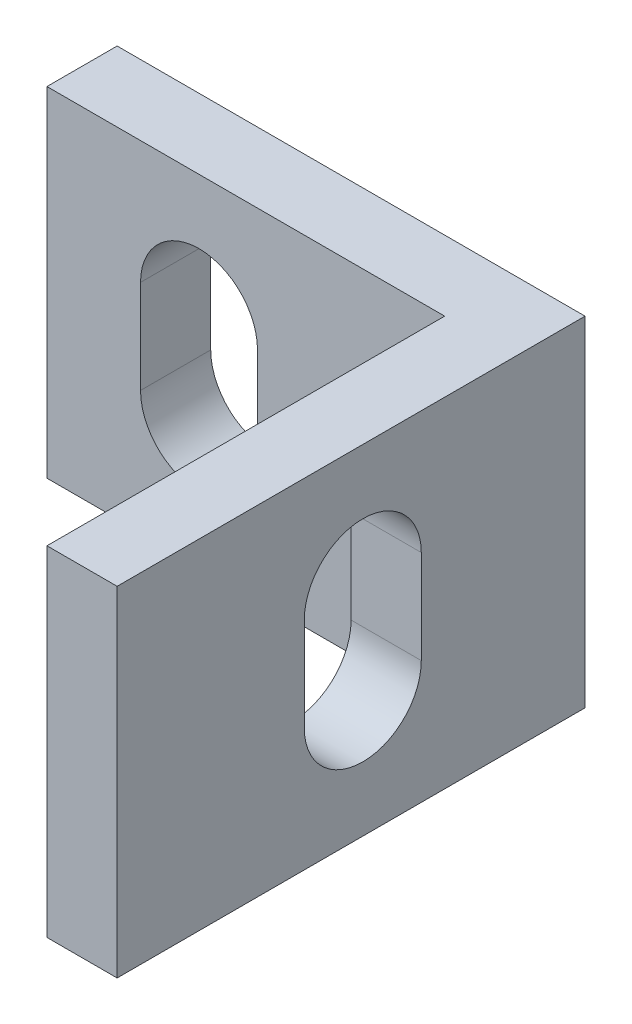
ISO-10303-21;
HEADER;
FILE_DESCRIPTION(('STEP AP214'),'2;1');
FILE_NAME('part.step','',(''),(''),'','','');
FILE_SCHEMA(('AUTOMOTIVE_DESIGN { 1 0 10303 214 1 1 1 1 }'));
ENDSEC;
DATA;
#1=APPLICATION_CONTEXT('core data for automotive mechanical design processes');
#2=APPLICATION_PROTOCOL_DEFINITION('international standard','automotive_design',2000,#1);
#3=PRODUCT_CONTEXT('',#1,'mechanical');
#4=PRODUCT('Part','Part','',(#3));
#5=PRODUCT_RELATED_PRODUCT_CATEGORY('part','',(#4));
#6=PRODUCT_DEFINITION_FORMATION('','',#4);
#7=PRODUCT_DEFINITION_CONTEXT('part definition',#1,'design');
#8=PRODUCT_DEFINITION('design','',#6,#7);
#9=PRODUCT_DEFINITION_SHAPE('','',#8);
#10=(LENGTH_UNIT() NAMED_UNIT(*) SI_UNIT(.MILLI.,.METRE.));
#11=(NAMED_UNIT(*) PLANE_ANGLE_UNIT() SI_UNIT($,.RADIAN.));
#12=(NAMED_UNIT(*) SI_UNIT($,.STERADIAN.) SOLID_ANGLE_UNIT());
#13=UNCERTAINTY_MEASURE_WITH_UNIT(LENGTH_MEASURE(1.E-05),#10,'distance_accuracy_value','');
#14=(GEOMETRIC_REPRESENTATION_CONTEXT(3) GLOBAL_UNCERTAINTY_ASSIGNED_CONTEXT((#13)) GLOBAL_UNIT_ASSIGNED_CONTEXT((#10,
#11,#12)) REPRESENTATION_CONTEXT('',''));
#15=CARTESIAN_POINT('',(0.,0.,0.));
#16=DIRECTION('',(0.,0.,1.));
#17=DIRECTION('',(1.,0.,0.));
#18=AXIS2_PLACEMENT_3D('',#15,#16,#17);
#19=CARTESIAN_POINT('',(-17.,7.25,0.));
#20=DIRECTION('',(0.,0.,-1.));
#21=DIRECTION('',(-1.,0.,0.));
#22=AXIS2_PLACEMENT_3D('',#19,#20,#21);
#23=PLANE('',#22);
#24=DIRECTION('',(0.,1.,0.));
#25=VECTOR('',#24,1.);
#26=CARTESIAN_POINT('',(-13.,7.25,0.));
#27=LINE('',#26,#25);
#28=CARTESIAN_POINT('',(-13.,-2.,0.));
#29=VERTEX_POINT('',#28);
#30=CARTESIAN_POINT('',(-13.,2.,0.));
#31=VERTEX_POINT('',#30);
#32=EDGE_CURVE('E188',#29,#31,#27,.T.);
#33=ORIENTED_EDGE('',*,*,#32,.T.);
#34=CARTESIAN_POINT('',(-10.5,2.,0.));
#35=DIRECTION('',(0.,0.,-1.));
#36=DIRECTION('',(-1.,0.,0.));
#37=AXIS2_PLACEMENT_3D('',#34,#35,#36);
#38=CIRCLE('',#37,2.5);
#39=CARTESIAN_POINT('',(-8.,2.,0.));
#40=VERTEX_POINT('',#39);
#41=EDGE_CURVE('E204',#31,#40,#38,.T.);
#42=ORIENTED_EDGE('',*,*,#41,.T.);
#43=DIRECTION('',(0.,-1.,0.));
#44=VECTOR('',#43,1.);
#45=CARTESIAN_POINT('',(-8.,7.25,0.));
#46=LINE('',#45,#44);
#47=CARTESIAN_POINT('',(-8.,-2.,0.));
#48=VERTEX_POINT('',#47);
#49=EDGE_CURVE('E201',#40,#48,#46,.T.);
#50=ORIENTED_EDGE('',*,*,#49,.T.);
#51=CARTESIAN_POINT('',(-10.5,-2.,0.));
#52=DIRECTION('',(0.,0.,-1.));
#53=DIRECTION('',(-1.,0.,0.));
#54=AXIS2_PLACEMENT_3D('',#51,#52,#53);
#55=CIRCLE('',#54,2.5);
#56=EDGE_CURVE('E198',#48,#29,#55,.T.);
#57=ORIENTED_EDGE('',*,*,#56,.T.);
#58=EDGE_LOOP('',(#33,#42,#50,#57));
#59=FACE_BOUND('',#58,.T.);
#60=DIRECTION('',(1.,0.,0.));
#61=VECTOR('',#60,1.);
#62=CARTESIAN_POINT('',(-17.,-7.25,0.));
#63=LINE('',#62,#61);
#64=CARTESIAN_POINT('',(-17.,-7.25,0.));
#65=VERTEX_POINT('',#64);
#66=CARTESIAN_POINT('',(0.,-7.25,0.));
#67=VERTEX_POINT('',#66);
#68=EDGE_CURVE('E207',#65,#67,#63,.T.);
#69=ORIENTED_EDGE('',*,*,#68,.T.);
#70=DIRECTION('',(0.,-1.,0.));
#71=VECTOR('',#70,1.);
#72=CARTESIAN_POINT('',(0.,7.25,0.));
#73=LINE('',#72,#71);
#74=CARTESIAN_POINT('',(0.,7.25,0.));
#75=VERTEX_POINT('',#74);
#76=EDGE_CURVE('E11',#75,#67,#73,.T.);
#77=ORIENTED_EDGE('',*,*,#76,.F.);
#78=DIRECTION('',(1.,0.,0.));
#79=VECTOR('',#78,1.);
#80=CARTESIAN_POINT('',(-17.,7.25,0.));
#81=LINE('',#80,#79);
#82=CARTESIAN_POINT('',(-17.,7.25,0.));
#83=VERTEX_POINT('',#82);
#84=EDGE_CURVE('E208',#83,#75,#81,.T.);
#85=ORIENTED_EDGE('',*,*,#84,.F.);
#86=DIRECTION('',(0.,-1.,0.));
#87=VECTOR('',#86,1.);
#88=CARTESIAN_POINT('',(-17.,7.25,0.));
#89=LINE('',#88,#87);
#90=EDGE_CURVE('E222',#83,#65,#89,.T.);
#91=ORIENTED_EDGE('',*,*,#90,.T.);
#92=EDGE_LOOP('',(#69,#77,#85,#91));
#93=FACE_BOUND('',#92,.T.);
#94=ADVANCED_FACE('F35',(#59,#93),#23,.F.);
#95=CARTESIAN_POINT('',(0.,7.25,0.));
#96=DIRECTION('',(1.,0.,0.));
#97=DIRECTION('',(0.,0.,-1.));
#98=AXIS2_PLACEMENT_3D('',#95,#96,#97);
#99=PLANE('',#98);
#100=DIRECTION('',(0.,1.,0.));
#101=VECTOR('',#100,1.);
#102=CARTESIAN_POINT('',(0.,7.25,4.));
#103=LINE('',#102,#101);
#104=CARTESIAN_POINT('',(0.,-2.,4.));
#105=VERTEX_POINT('',#104);
#106=CARTESIAN_POINT('',(0.,2.,4.));
#107=VERTEX_POINT('',#106);
#108=EDGE_CURVE('E166',#105,#107,#103,.T.);
#109=ORIENTED_EDGE('',*,*,#108,.T.);
#110=CARTESIAN_POINT('',(0.,2.,6.5));
#111=DIRECTION('',(1.,0.,0.));
#112=DIRECTION('',(0.,0.,-1.));
#113=AXIS2_PLACEMENT_3D('',#110,#111,#112);
#114=CIRCLE('',#113,2.5);
#115=CARTESIAN_POINT('',(0.,2.,9.));
#116=VERTEX_POINT('',#115);
#117=EDGE_CURVE('E169',#107,#116,#114,.T.);
#118=ORIENTED_EDGE('',*,*,#117,.T.);
#119=DIRECTION('',(0.,-1.,0.));
#120=VECTOR('',#119,1.);
#121=CARTESIAN_POINT('',(0.,7.25,9.));
#122=LINE('',#121,#120);
#123=CARTESIAN_POINT('',(0.,-2.,9.));
#124=VERTEX_POINT('',#123);
#125=EDGE_CURVE('E161',#116,#124,#122,.T.);
#126=ORIENTED_EDGE('',*,*,#125,.T.);
#127=CARTESIAN_POINT('',(0.,-2.,6.5));
#128=DIRECTION('',(1.,0.,0.));
#129=DIRECTION('',(0.,0.,-1.));
#130=AXIS2_PLACEMENT_3D('',#127,#128,#129);
#131=CIRCLE('',#130,2.5);
#132=EDGE_CURVE('E141',#124,#105,#131,.T.);
#133=ORIENTED_EDGE('',*,*,#132,.T.);
#134=EDGE_LOOP('',(#109,#118,#126,#133));
#135=FACE_BOUND('',#134,.T.);
#136=DIRECTION('',(0.,0.,1.));
#137=VECTOR('',#136,1.);
#138=CARTESIAN_POINT('',(0.,-7.25,0.));
#139=LINE('',#138,#137);
#140=CARTESIAN_POINT('',(0.,-7.25,17.));
#141=VERTEX_POINT('',#140);
#142=EDGE_CURVE('E225',#67,#141,#139,.T.);
#143=ORIENTED_EDGE('',*,*,#142,.T.);
#144=DIRECTION('',(0.,-1.,0.));
#145=VECTOR('',#144,1.);
#146=CARTESIAN_POINT('',(0.,7.25,17.));
#147=LINE('',#146,#145);
#148=CARTESIAN_POINT('',(0.,7.25,17.));
#149=VERTEX_POINT('',#148);
#150=EDGE_CURVE('E42',#149,#141,#147,.T.);
#151=ORIENTED_EDGE('',*,*,#150,.F.);
#152=DIRECTION('',(0.,0.,1.));
#153=VECTOR('',#152,1.);
#154=CARTESIAN_POINT('',(0.,7.25,0.));
#155=LINE('',#154,#153);
#156=EDGE_CURVE('E211',#75,#149,#155,.T.);
#157=ORIENTED_EDGE('',*,*,#156,.F.);
#158=ORIENTED_EDGE('',*,*,#76,.T.);
#159=EDGE_LOOP('',(#143,#151,#157,#158));
#160=FACE_BOUND('',#159,.T.);
#161=ADVANCED_FACE('F270',(#135,#160),#99,.F.);
#162=CARTESIAN_POINT('',(0.,7.25,17.));
#163=DIRECTION('',(0.,0.,-1.));
#164=DIRECTION('',(-1.,0.,0.));
#165=AXIS2_PLACEMENT_3D('',#162,#163,#164);
#166=PLANE('',#165);
#167=DIRECTION('',(1.,0.,0.));
#168=VECTOR('',#167,1.);
#169=CARTESIAN_POINT('',(0.,-7.25,17.));
#170=LINE('',#169,#168);
#171=CARTESIAN_POINT('',(3.00000000000001,-7.25,17.));
#172=VERTEX_POINT('',#171);
#173=EDGE_CURVE('E227',#141,#172,#170,.T.);
#174=ORIENTED_EDGE('',*,*,#173,.T.);
#175=DIRECTION('',(0.,-1.,0.));
#176=VECTOR('',#175,1.);
#177=CARTESIAN_POINT('',(3.00000000000001,7.25,17.));
#178=LINE('',#177,#176);
#179=CARTESIAN_POINT('',(3.00000000000001,7.25,17.));
#180=VERTEX_POINT('',#179);
#181=EDGE_CURVE('E242',#180,#172,#178,.T.);
#182=ORIENTED_EDGE('',*,*,#181,.F.);
#183=DIRECTION('',(1.,0.,0.));
#184=VECTOR('',#183,1.);
#185=CARTESIAN_POINT('',(0.,7.25,17.));
#186=LINE('',#185,#184);
#187=EDGE_CURVE('E214',#149,#180,#186,.T.);
#188=ORIENTED_EDGE('',*,*,#187,.F.);
#189=ORIENTED_EDGE('',*,*,#150,.T.);
#190=EDGE_LOOP('',(#174,#182,#188,#189));
#191=FACE_BOUND('',#190,.T.);
#192=ADVANCED_FACE('F249',(#191),#166,.F.);
#193=CARTESIAN_POINT('',(3.00000000000001,7.25,17.));
#194=DIRECTION('',(-1.,0.,0.));
#195=DIRECTION('',(0.,0.,1.));
#196=AXIS2_PLACEMENT_3D('',#193,#194,#195);
#197=PLANE('',#196);
#198=DIRECTION('',(0.,-1.,0.));
#199=VECTOR('',#198,1.);
#200=CARTESIAN_POINT('',(3.00000000000001,2.,9.));
#201=LINE('',#200,#199);
#202=CARTESIAN_POINT('',(3.,2.,9.));
#203=VERTEX_POINT('',#202);
#204=CARTESIAN_POINT('',(3.00000000000001,-2.,9.));
#205=VERTEX_POINT('',#204);
#206=EDGE_CURVE('E147',#203,#205,#201,.T.);
#207=ORIENTED_EDGE('',*,*,#206,.F.);
#208=CARTESIAN_POINT('',(3.00000000000001,2.,6.5));
#209=DIRECTION('',(1.,0.,0.));
#210=DIRECTION('',(0.,0.,-1.));
#211=AXIS2_PLACEMENT_3D('',#208,#209,#210);
#212=CIRCLE('',#211,2.5);
#213=CARTESIAN_POINT('',(3.00000000000001,2.,4.));
#214=VERTEX_POINT('',#213);
#215=EDGE_CURVE('E57',#214,#203,#212,.T.);
#216=ORIENTED_EDGE('',*,*,#215,.F.);
#217=DIRECTION('',(0.,1.,0.));
#218=VECTOR('',#217,1.);
#219=CARTESIAN_POINT('',(3.00000000000001,2.,4.));
#220=LINE('',#219,#218);
#221=CARTESIAN_POINT('',(3.00000000000001,-2.,4.));
#222=VERTEX_POINT('',#221);
#223=EDGE_CURVE('E154',#222,#214,#220,.T.);
#224=ORIENTED_EDGE('',*,*,#223,.F.);
#225=CARTESIAN_POINT('',(3.00000000000001,-2.,6.5));
#226=DIRECTION('',(1.,0.,0.));
#227=DIRECTION('',(0.,0.,-1.));
#228=AXIS2_PLACEMENT_3D('',#225,#226,#227);
#229=CIRCLE('',#228,2.5);
#230=EDGE_CURVE('E138',#205,#222,#229,.T.);
#231=ORIENTED_EDGE('',*,*,#230,.F.);
#232=EDGE_LOOP('',(#207,#216,#224,#231));
#233=FACE_BOUND('',#232,.T.);
#234=DIRECTION('',(0.,0.,-1.));
#235=VECTOR('',#234,1.);
#236=CARTESIAN_POINT('',(3.00000000000001,-7.25,17.));
#237=LINE('',#236,#235);
#238=CARTESIAN_POINT('',(3.,-7.25,-3.));
#239=VERTEX_POINT('',#238);
#240=EDGE_CURVE('E229',#172,#239,#237,.T.);
#241=ORIENTED_EDGE('',*,*,#240,.T.);
#242=DIRECTION('',(0.,-1.,0.));
#243=VECTOR('',#242,1.);
#244=CARTESIAN_POINT('',(3.,7.25,-3.));
#245=LINE('',#244,#243);
#246=CARTESIAN_POINT('',(3.,7.25,-3.));
#247=VERTEX_POINT('',#246);
#248=EDGE_CURVE('E239',#247,#239,#245,.T.);
#249=ORIENTED_EDGE('',*,*,#248,.F.);
#250=DIRECTION('',(0.,0.,-1.));
#251=VECTOR('',#250,1.);
#252=CARTESIAN_POINT('',(3.00000000000001,7.25,17.));
#253=LINE('',#252,#251);
#254=EDGE_CURVE('E216',#180,#247,#253,.T.);
#255=ORIENTED_EDGE('',*,*,#254,.F.);
#256=ORIENTED_EDGE('',*,*,#181,.T.);
#257=EDGE_LOOP('',(#241,#249,#255,#256));
#258=FACE_BOUND('',#257,.T.);
#259=ADVANCED_FACE('F151',(#233,#258),#197,.F.);
#260=CARTESIAN_POINT('',(3.,7.25,-3.));
#261=DIRECTION('',(0.,0.,1.));
#262=DIRECTION('',(1.,0.,0.));
#263=AXIS2_PLACEMENT_3D('',#260,#261,#262);
#264=PLANE('',#263);
#265=DIRECTION('',(0.,1.,0.));
#266=VECTOR('',#265,1.);
#267=CARTESIAN_POINT('',(-8.,2.,-3.));
#268=LINE('',#267,#266);
#269=CARTESIAN_POINT('',(-8.,-2.,-3.));
#270=VERTEX_POINT('',#269);
#271=CARTESIAN_POINT('',(-8.,2.,-3.));
#272=VERTEX_POINT('',#271);
#273=EDGE_CURVE('E181',#270,#272,#268,.T.);
#274=ORIENTED_EDGE('',*,*,#273,.T.);
#275=CARTESIAN_POINT('',(-10.5,2.,-3.));
#276=DIRECTION('',(0.,0.,1.));
#277=DIRECTION('',(1.,0.,0.));
#278=AXIS2_PLACEMENT_3D('',#275,#276,#277);
#279=CIRCLE('',#278,2.5);
#280=CARTESIAN_POINT('',(-13.,2.,-3.));
#281=VERTEX_POINT('',#280);
#282=EDGE_CURVE('E172',#272,#281,#279,.T.);
#283=ORIENTED_EDGE('',*,*,#282,.T.);
#284=DIRECTION('',(0.,-1.,0.));
#285=VECTOR('',#284,1.);
#286=CARTESIAN_POINT('',(-13.,2.,-3.));
#287=LINE('',#286,#285);
#288=CARTESIAN_POINT('',(-13.,-2.,-3.));
#289=VERTEX_POINT('',#288);
#290=EDGE_CURVE('E175',#281,#289,#287,.T.);
#291=ORIENTED_EDGE('',*,*,#290,.T.);
#292=CARTESIAN_POINT('',(-10.5,-2.,-3.));
#293=DIRECTION('',(0.,0.,1.));
#294=DIRECTION('',(1.,0.,0.));
#295=AXIS2_PLACEMENT_3D('',#292,#293,#294);
#296=CIRCLE('',#295,2.5);
#297=EDGE_CURVE('E178',#289,#270,#296,.T.);
#298=ORIENTED_EDGE('',*,*,#297,.T.);
#299=EDGE_LOOP('',(#274,#283,#291,#298));
#300=FACE_BOUND('',#299,.T.);
#301=DIRECTION('',(-1.,0.,0.));
#302=VECTOR('',#301,1.);
#303=CARTESIAN_POINT('',(3.,-7.25,-3.));
#304=LINE('',#303,#302);
#305=CARTESIAN_POINT('',(-17.,-7.25,-3.));
#306=VERTEX_POINT('',#305);
#307=EDGE_CURVE('E231',#239,#306,#304,.T.);
#308=ORIENTED_EDGE('',*,*,#307,.T.);
#309=DIRECTION('',(0.,-1.,0.));
#310=VECTOR('',#309,1.);
#311=CARTESIAN_POINT('',(-17.,7.25,-3.));
#312=LINE('',#311,#310);
#313=CARTESIAN_POINT('',(-17.,7.25,-3.));
#314=VERTEX_POINT('',#313);
#315=EDGE_CURVE('E236',#314,#306,#312,.T.);
#316=ORIENTED_EDGE('',*,*,#315,.F.);
#317=DIRECTION('',(-1.,0.,0.));
#318=VECTOR('',#317,1.);
#319=CARTESIAN_POINT('',(3.,7.25,-3.));
#320=LINE('',#319,#318);
#321=EDGE_CURVE('E218',#247,#314,#320,.T.);
#322=ORIENTED_EDGE('',*,*,#321,.F.);
#323=ORIENTED_EDGE('',*,*,#248,.T.);
#324=EDGE_LOOP('',(#308,#316,#322,#323));
#325=FACE_BOUND('',#324,.T.);
#326=ADVANCED_FACE('F262',(#300,#325),#264,.F.);
#327=CARTESIAN_POINT('',(-17.,7.25,-3.));
#328=DIRECTION('',(1.,0.,0.));
#329=DIRECTION('',(0.,0.,-1.));
#330=AXIS2_PLACEMENT_3D('',#327,#328,#329);
#331=PLANE('',#330);
#332=DIRECTION('',(0.,0.,1.));
#333=VECTOR('',#332,1.);
#334=CARTESIAN_POINT('',(-17.,-7.25,-3.));
#335=LINE('',#334,#333);
#336=EDGE_CURVE('E212',#306,#65,#335,.T.);
#337=ORIENTED_EDGE('',*,*,#336,.T.);
#338=ORIENTED_EDGE('',*,*,#90,.F.);
#339=DIRECTION('',(0.,0.,1.));
#340=VECTOR('',#339,1.);
#341=CARTESIAN_POINT('',(-17.,7.25,-3.));
#342=LINE('',#341,#340);
#343=EDGE_CURVE('E220',#314,#83,#342,.T.);
#344=ORIENTED_EDGE('',*,*,#343,.F.);
#345=ORIENTED_EDGE('',*,*,#315,.T.);
#346=EDGE_LOOP('',(#337,#338,#344,#345));
#347=FACE_BOUND('',#346,.T.);
#348=ADVANCED_FACE('F273',(#347),#331,.F.);
#349=CARTESIAN_POINT('',(0.,7.25,0.));
#350=DIRECTION('',(0.,-1.,0.));
#351=DIRECTION('',(0.,0.,-1.));
#352=AXIS2_PLACEMENT_3D('',#349,#350,#351);
#353=PLANE('',#352);
#354=ORIENTED_EDGE('',*,*,#84,.T.);
#355=ORIENTED_EDGE('',*,*,#156,.T.);
#356=ORIENTED_EDGE('',*,*,#187,.T.);
#357=ORIENTED_EDGE('',*,*,#254,.T.);
#358=ORIENTED_EDGE('',*,*,#321,.T.);
#359=ORIENTED_EDGE('',*,*,#343,.T.);
#360=EDGE_LOOP('',(#354,#355,#356,#357,#358,#359));
#361=FACE_BOUND('',#360,.T.);
#362=ADVANCED_FACE('F266',(#361),#353,.F.);
#363=CARTESIAN_POINT('',(0.,-7.25,0.));
#364=DIRECTION('',(0.,-1.,0.));
#365=DIRECTION('',(0.,0.,-1.));
#366=AXIS2_PLACEMENT_3D('',#363,#364,#365);
#367=PLANE('',#366);
#368=ORIENTED_EDGE('',*,*,#68,.F.);
#369=ORIENTED_EDGE('',*,*,#336,.F.);
#370=ORIENTED_EDGE('',*,*,#307,.F.);
#371=ORIENTED_EDGE('',*,*,#240,.F.);
#372=ORIENTED_EDGE('',*,*,#173,.F.);
#373=ORIENTED_EDGE('',*,*,#142,.F.);
#374=EDGE_LOOP('',(#368,#369,#370,#371,#372,#373));
#375=FACE_BOUND('',#374,.T.);
#376=ADVANCED_FACE('F255',(#375),#367,.T.);
#377=CARTESIAN_POINT('',(-10.5,2.,-3.));
#378=DIRECTION('',(0.,0.,1.));
#379=DIRECTION('',(1.,0.,0.));
#380=AXIS2_PLACEMENT_3D('',#377,#378,#379);
#381=CYLINDRICAL_SURFACE('',#380,2.5);
#382=DIRECTION('',(0.,0.,1.));
#383=VECTOR('',#382,1.);
#384=CARTESIAN_POINT('',(-13.,2.,-3.));
#385=LINE('',#384,#383);
#386=EDGE_CURVE('E184',#281,#31,#385,.T.);
#387=ORIENTED_EDGE('',*,*,#386,.F.);
#388=ORIENTED_EDGE('',*,*,#282,.F.);
#389=DIRECTION('',(0.,0.,1.));
#390=VECTOR('',#389,1.);
#391=CARTESIAN_POINT('',(-8.,2.,-3.));
#392=LINE('',#391,#390);
#393=EDGE_CURVE('E185',#272,#40,#392,.T.);
#394=ORIENTED_EDGE('',*,*,#393,.T.);
#395=ORIENTED_EDGE('',*,*,#41,.F.);
#396=EDGE_LOOP('',(#387,#388,#394,#395));
#397=FACE_BOUND('',#396,.T.);
#398=ADVANCED_FACE('F300',(#397),#381,.F.);
#399=CARTESIAN_POINT('',(-8.,2.,-3.));
#400=DIRECTION('',(1.,0.,0.));
#401=DIRECTION('',(0.,0.,-1.));
#402=AXIS2_PLACEMENT_3D('',#399,#400,#401);
#403=PLANE('',#402);
#404=ORIENTED_EDGE('',*,*,#393,.F.);
#405=ORIENTED_EDGE('',*,*,#273,.F.);
#406=DIRECTION('',(0.,0.,1.));
#407=VECTOR('',#406,1.);
#408=CARTESIAN_POINT('',(-8.,-2.,-3.));
#409=LINE('',#408,#407);
#410=EDGE_CURVE('E189',#270,#48,#409,.T.);
#411=ORIENTED_EDGE('',*,*,#410,.T.);
#412=ORIENTED_EDGE('',*,*,#49,.F.);
#413=EDGE_LOOP('',(#404,#405,#411,#412));
#414=FACE_BOUND('',#413,.T.);
#415=ADVANCED_FACE('F302',(#414),#403,.F.);
#416=CARTESIAN_POINT('',(-10.5,-2.,-3.));
#417=DIRECTION('',(0.,0.,1.));
#418=DIRECTION('',(1.,0.,0.));
#419=AXIS2_PLACEMENT_3D('',#416,#417,#418);
#420=CYLINDRICAL_SURFACE('',#419,2.5);
#421=ORIENTED_EDGE('',*,*,#410,.F.);
#422=ORIENTED_EDGE('',*,*,#297,.F.);
#423=DIRECTION('',(0.,0.,1.));
#424=VECTOR('',#423,1.);
#425=CARTESIAN_POINT('',(-13.,-2.,-3.));
#426=LINE('',#425,#424);
#427=EDGE_CURVE('E192',#289,#29,#426,.T.);
#428=ORIENTED_EDGE('',*,*,#427,.T.);
#429=ORIENTED_EDGE('',*,*,#56,.F.);
#430=EDGE_LOOP('',(#421,#422,#428,#429));
#431=FACE_BOUND('',#430,.T.);
#432=ADVANCED_FACE('F296',(#431),#420,.F.);
#433=CARTESIAN_POINT('',(-13.,2.,-3.));
#434=DIRECTION('',(-1.,0.,0.));
#435=DIRECTION('',(0.,0.,1.));
#436=AXIS2_PLACEMENT_3D('',#433,#434,#435);
#437=PLANE('',#436);
#438=ORIENTED_EDGE('',*,*,#427,.F.);
#439=ORIENTED_EDGE('',*,*,#290,.F.);
#440=ORIENTED_EDGE('',*,*,#386,.T.);
#441=ORIENTED_EDGE('',*,*,#32,.F.);
#442=EDGE_LOOP('',(#438,#439,#440,#441));
#443=FACE_BOUND('',#442,.T.);
#444=ADVANCED_FACE('F293',(#443),#437,.F.);
#445=CARTESIAN_POINT('',(-17.,2.,6.5));
#446=DIRECTION('',(1.,0.,0.));
#447=DIRECTION('',(0.,0.,-1.));
#448=AXIS2_PLACEMENT_3D('',#445,#446,#447);
#449=CYLINDRICAL_SURFACE('',#448,2.5);
#450=DIRECTION('',(1.,0.,0.));
#451=VECTOR('',#450,1.);
#452=CARTESIAN_POINT('',(-17.,2.,4.));
#453=LINE('',#452,#451);
#454=EDGE_CURVE('E159',#107,#214,#453,.T.);
#455=ORIENTED_EDGE('',*,*,#454,.T.);
#456=ORIENTED_EDGE('',*,*,#215,.T.);
#457=DIRECTION('',(1.,0.,0.));
#458=VECTOR('',#457,1.);
#459=CARTESIAN_POINT('',(-17.,2.,9.));
#460=LINE('',#459,#458);
#461=EDGE_CURVE('E144',#116,#203,#460,.T.);
#462=ORIENTED_EDGE('',*,*,#461,.F.);
#463=ORIENTED_EDGE('',*,*,#117,.F.);
#464=EDGE_LOOP('',(#455,#456,#462,#463));
#465=FACE_BOUND('',#464,.T.);
#466=ADVANCED_FACE('F312',(#465),#449,.F.);
#467=CARTESIAN_POINT('',(-17.,2.,4.));
#468=DIRECTION('',(0.,0.,-1.));
#469=DIRECTION('',(-1.,0.,0.));
#470=AXIS2_PLACEMENT_3D('',#467,#468,#469);
#471=PLANE('',#470);
#472=DIRECTION('',(1.,0.,0.));
#473=VECTOR('',#472,1.);
#474=CARTESIAN_POINT('',(-17.,-2.,4.));
#475=LINE('',#474,#473);
#476=EDGE_CURVE('E143',#105,#222,#475,.T.);
#477=ORIENTED_EDGE('',*,*,#476,.T.);
#478=ORIENTED_EDGE('',*,*,#223,.T.);
#479=ORIENTED_EDGE('',*,*,#454,.F.);
#480=ORIENTED_EDGE('',*,*,#108,.F.);
#481=EDGE_LOOP('',(#477,#478,#479,#480));
#482=FACE_BOUND('',#481,.T.);
#483=ADVANCED_FACE('F370',(#482),#471,.F.);
#484=CARTESIAN_POINT('',(-17.,-2.,6.5));
#485=DIRECTION('',(1.,0.,0.));
#486=DIRECTION('',(0.,0.,-1.));
#487=AXIS2_PLACEMENT_3D('',#484,#485,#486);
#488=CYLINDRICAL_SURFACE('',#487,2.5);
#489=DIRECTION('',(1.,0.,0.));
#490=VECTOR('',#489,1.);
#491=CARTESIAN_POINT('',(-17.,-2.,9.));
#492=LINE('',#491,#490);
#493=EDGE_CURVE('E49',#124,#205,#492,.T.);
#494=ORIENTED_EDGE('',*,*,#493,.T.);
#495=ORIENTED_EDGE('',*,*,#230,.T.);
#496=ORIENTED_EDGE('',*,*,#476,.F.);
#497=ORIENTED_EDGE('',*,*,#132,.F.);
#498=EDGE_LOOP('',(#494,#495,#496,#497));
#499=FACE_BOUND('',#498,.T.);
#500=ADVANCED_FACE('F135',(#499),#488,.F.);
#501=CARTESIAN_POINT('',(-17.,2.,9.));
#502=DIRECTION('',(0.,0.,1.));
#503=DIRECTION('',(1.,0.,0.));
#504=AXIS2_PLACEMENT_3D('',#501,#502,#503);
#505=PLANE('',#504);
#506=ORIENTED_EDGE('',*,*,#461,.T.);
#507=ORIENTED_EDGE('',*,*,#206,.T.);
#508=ORIENTED_EDGE('',*,*,#493,.F.);
#509=ORIENTED_EDGE('',*,*,#125,.F.);
#510=EDGE_LOOP('',(#506,#507,#508,#509));
#511=FACE_BOUND('',#510,.T.);
#512=ADVANCED_FACE('F148',(#511),#505,.F.);
#513=CLOSED_SHELL('',(#94,#161,#192,#259,#326,#348,#362,#376,#398,#415,#432,#444,#466,#483,#500,#512));
#514=MANIFOLD_SOLID_BREP('B2',#513);
#515=ADVANCED_BREP_SHAPE_REPRESENTATION('',(#18,#514),#14);
#516=SHAPE_DEFINITION_REPRESENTATION(#9,#515);
ENDSEC;
END-ISO-10303-21;
